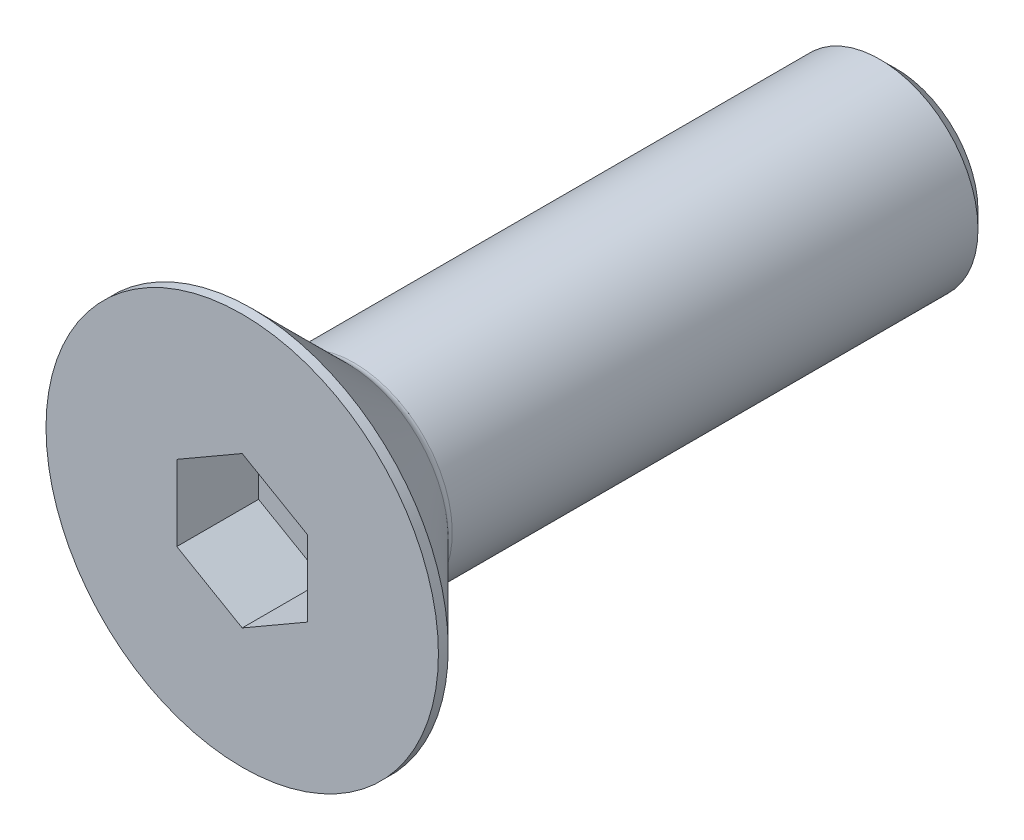
ISO-10303-21;
HEADER;
FILE_DESCRIPTION(('STEP AP214'),'2;1');
FILE_NAME('part.step','',(''),(''),'','','');
FILE_SCHEMA(('AUTOMOTIVE_DESIGN { 1 0 10303 214 1 1 1 1 }'));
ENDSEC;
DATA;
#1=APPLICATION_CONTEXT('core data for automotive mechanical design processes');
#2=APPLICATION_PROTOCOL_DEFINITION('international standard','automotive_design',2000,#1);
#3=PRODUCT_CONTEXT('',#1,'mechanical');
#4=PRODUCT('Part','Part','',(#3));
#5=PRODUCT_RELATED_PRODUCT_CATEGORY('part','',(#4));
#6=PRODUCT_DEFINITION_FORMATION('','',#4);
#7=PRODUCT_DEFINITION_CONTEXT('part definition',#1,'design');
#8=PRODUCT_DEFINITION('design','',#6,#7);
#9=PRODUCT_DEFINITION_SHAPE('','',#8);
#10=(LENGTH_UNIT() NAMED_UNIT(*) SI_UNIT(.MILLI.,.METRE.));
#11=(NAMED_UNIT(*) PLANE_ANGLE_UNIT() SI_UNIT($,.RADIAN.));
#12=(NAMED_UNIT(*) SI_UNIT($,.STERADIAN.) SOLID_ANGLE_UNIT());
#13=UNCERTAINTY_MEASURE_WITH_UNIT(LENGTH_MEASURE(1.E-05),#10,'distance_accuracy_value','');
#14=(GEOMETRIC_REPRESENTATION_CONTEXT(3) GLOBAL_UNCERTAINTY_ASSIGNED_CONTEXT((#13)) GLOBAL_UNIT_ASSIGNED_CONTEXT((#10,
#11,#12)) REPRESENTATION_CONTEXT('',''));
#15=CARTESIAN_POINT('',(0.,0.,0.));
#16=DIRECTION('',(0.,0.,1.));
#17=DIRECTION('',(1.,0.,0.));
#18=AXIS2_PLACEMENT_3D('',#15,#16,#17);
#19=CARTESIAN_POINT('',(0.,0.,-2.5));
#20=DIRECTION('',(0.,0.,1.));
#21=DIRECTION('',(1.,0.,0.));
#22=AXIS2_PLACEMENT_3D('',#19,#20,#21);
#23=PLANE('',#22);
#24=DIRECTION('',(-0.866025403784439,-0.5,0.));
#25=VECTOR('',#24,1.);
#26=CARTESIAN_POINT('',(0.,2.3094010767585,-2.5));
#27=LINE('',#26,#25);
#28=CARTESIAN_POINT('',(0.,2.3094010767585,-2.5));
#29=VERTEX_POINT('',#28);
#30=CARTESIAN_POINT('',(-2.,1.15470053837925,-2.5));
#31=VERTEX_POINT('',#30);
#32=EDGE_CURVE('E81',#29,#31,#27,.T.);
#33=ORIENTED_EDGE('',*,*,#32,.T.);
#34=DIRECTION('',(0.,1.,0.));
#35=VECTOR('',#34,1.);
#36=CARTESIAN_POINT('',(-2.,1.15470053837925,-2.5));
#37=LINE('',#36,#35);
#38=CARTESIAN_POINT('',(-2.,-1.15470053837925,-2.5));
#39=VERTEX_POINT('',#38);
#40=EDGE_CURVE('E65',#31,#39,#37,.F.);
#41=ORIENTED_EDGE('',*,*,#40,.T.);
#42=DIRECTION('',(0.866025403784439,-0.499999999999999,0.));
#43=VECTOR('',#42,1.);
#44=CARTESIAN_POINT('',(-2.,-1.15470053837925,-2.5));
#45=LINE('',#44,#43);
#46=CARTESIAN_POINT('',(0.,-2.3094010767585,-2.5));
#47=VERTEX_POINT('',#46);
#48=EDGE_CURVE('E70',#39,#47,#45,.T.);
#49=ORIENTED_EDGE('',*,*,#48,.T.);
#50=DIRECTION('',(0.866025403784439,0.5,0.));
#51=VECTOR('',#50,1.);
#52=CARTESIAN_POINT('',(0.,-2.3094010767585,-2.5));
#53=LINE('',#52,#51);
#54=CARTESIAN_POINT('',(2.,-1.15470053837925,-2.5));
#55=VERTEX_POINT('',#54);
#56=EDGE_CURVE('E127',#47,#55,#53,.T.);
#57=ORIENTED_EDGE('',*,*,#56,.T.);
#58=DIRECTION('',(0.,1.,0.));
#59=VECTOR('',#58,1.);
#60=CARTESIAN_POINT('',(2.,-1.15470053837925,-2.5));
#61=LINE('',#60,#59);
#62=CARTESIAN_POINT('',(2.,1.15470053837925,-2.5));
#63=VERTEX_POINT('',#62);
#64=EDGE_CURVE('E131',#55,#63,#61,.T.);
#65=ORIENTED_EDGE('',*,*,#64,.T.);
#66=DIRECTION('',(-0.866025403784439,0.499999999999999,0.));
#67=VECTOR('',#66,1.);
#68=CARTESIAN_POINT('',(2.,1.15470053837925,-2.5));
#69=LINE('',#68,#67);
#70=EDGE_CURVE('E136',#63,#29,#69,.T.);
#71=ORIENTED_EDGE('',*,*,#70,.T.);
#72=EDGE_LOOP('',(#33,#41,#49,#57,#65,#71));
#73=FACE_BOUND('',#72,.T.);
#74=ADVANCED_FACE('F14',(#73),#23,.T.);
#75=CARTESIAN_POINT('',(-2.,-1.15470053837925,0.));
#76=DIRECTION('',(-0.499999999999999,-0.866025403784439,0.));
#77=DIRECTION('',(0.866025403784439,-0.499999999999999,0.));
#78=AXIS2_PLACEMENT_3D('',#75,#76,#77);
#79=PLANE('',#78);
#80=DIRECTION('',(0.,0.,1.));
#81=VECTOR('',#80,1.);
#82=CARTESIAN_POINT('',(-2.,-1.15470053837925,0.));
#83=LINE('',#82,#81);
#84=CARTESIAN_POINT('',(-2.,-1.15470053837925,0.));
#85=VERTEX_POINT('',#84);
#86=EDGE_CURVE('E72',#39,#85,#83,.T.);
#87=ORIENTED_EDGE('',*,*,#86,.T.);
#88=DIRECTION('',(-0.866025403784439,0.499999999999999,0.));
#89=VECTOR('',#88,1.);
#90=CARTESIAN_POINT('',(0.,-2.3094010767585,0.));
#91=LINE('',#90,#89);
#92=CARTESIAN_POINT('',(0.,-2.3094010767585,0.));
#93=VERTEX_POINT('',#92);
#94=EDGE_CURVE('E125',#93,#85,#91,.T.);
#95=ORIENTED_EDGE('',*,*,#94,.F.);
#96=DIRECTION('',(0.,0.,1.));
#97=VECTOR('',#96,1.);
#98=CARTESIAN_POINT('',(0.,-2.3094010767585,0.));
#99=LINE('',#98,#97);
#100=EDGE_CURVE('E75',#93,#47,#99,.F.);
#101=ORIENTED_EDGE('',*,*,#100,.T.);
#102=ORIENTED_EDGE('',*,*,#48,.F.);
#103=EDGE_LOOP('',(#87,#95,#101,#102));
#104=FACE_BOUND('',#103,.T.);
#105=ADVANCED_FACE('F71',(#104),#79,.F.);
#106=CARTESIAN_POINT('',(-2.,1.15470053837925,0.));
#107=DIRECTION('',(-1.,0.,0.));
#108=DIRECTION('',(0.,0.,1.));
#109=AXIS2_PLACEMENT_3D('',#106,#107,#108);
#110=PLANE('',#109);
#111=DIRECTION('',(0.,0.,1.));
#112=VECTOR('',#111,1.);
#113=CARTESIAN_POINT('',(-2.,1.15470053837925,0.));
#114=LINE('',#113,#112);
#115=CARTESIAN_POINT('',(-2.,1.15470053837925,0.));
#116=VERTEX_POINT('',#115);
#117=EDGE_CURVE('E83',#31,#116,#114,.T.);
#118=ORIENTED_EDGE('',*,*,#117,.T.);
#119=DIRECTION('',(0.,1.,0.));
#120=VECTOR('',#119,1.);
#121=CARTESIAN_POINT('',(-2.,0.,0.));
#122=LINE('',#121,#120);
#123=EDGE_CURVE('E87',#85,#116,#122,.T.);
#124=ORIENTED_EDGE('',*,*,#123,.F.);
#125=ORIENTED_EDGE('',*,*,#86,.F.);
#126=ORIENTED_EDGE('',*,*,#40,.F.);
#127=EDGE_LOOP('',(#118,#124,#125,#126));
#128=FACE_BOUND('',#127,.T.);
#129=ADVANCED_FACE('F85',(#128),#110,.F.);
#130=CARTESIAN_POINT('',(0.,2.3094010767585,0.));
#131=DIRECTION('',(-0.5,0.866025403784439,0.));
#132=DIRECTION('',(-0.866025403784439,-0.5,0.));
#133=AXIS2_PLACEMENT_3D('',#130,#131,#132);
#134=PLANE('',#133);
#135=DIRECTION('',(0.,0.,1.));
#136=VECTOR('',#135,1.);
#137=CARTESIAN_POINT('',(0.,2.3094010767585,0.));
#138=LINE('',#137,#136);
#139=CARTESIAN_POINT('',(0.,2.3094010767585,0.));
#140=VERTEX_POINT('',#139);
#141=EDGE_CURVE('E138',#29,#140,#138,.T.);
#142=ORIENTED_EDGE('',*,*,#141,.T.);
#143=DIRECTION('',(0.866025403784439,0.5,0.));
#144=VECTOR('',#143,1.);
#145=CARTESIAN_POINT('',(-2.,1.15470053837925,0.));
#146=LINE('',#145,#144);
#147=EDGE_CURVE('E121',#116,#140,#146,.T.);
#148=ORIENTED_EDGE('',*,*,#147,.F.);
#149=ORIENTED_EDGE('',*,*,#117,.F.);
#150=ORIENTED_EDGE('',*,*,#32,.F.);
#151=EDGE_LOOP('',(#142,#148,#149,#150));
#152=FACE_BOUND('',#151,.T.);
#153=ADVANCED_FACE('F142',(#152),#134,.F.);
#154=CARTESIAN_POINT('',(2.,1.15470053837925,0.));
#155=DIRECTION('',(0.499999999999999,0.866025403784439,0.));
#156=DIRECTION('',(-0.866025403784439,0.499999999999999,0.));
#157=AXIS2_PLACEMENT_3D('',#154,#155,#156);
#158=PLANE('',#157);
#159=DIRECTION('',(0.,0.,-1.));
#160=VECTOR('',#159,1.);
#161=CARTESIAN_POINT('',(2.,1.15470053837925,0.));
#162=LINE('',#161,#160);
#163=CARTESIAN_POINT('',(2.,1.15470053837925,0.));
#164=VERTEX_POINT('',#163);
#165=EDGE_CURVE('E134',#63,#164,#162,.F.);
#166=ORIENTED_EDGE('',*,*,#165,.T.);
#167=DIRECTION('',(0.866025403784439,-0.499999999999999,0.));
#168=VECTOR('',#167,1.);
#169=CARTESIAN_POINT('',(0.,2.3094010767585,0.));
#170=LINE('',#169,#168);
#171=EDGE_CURVE('E118',#140,#164,#170,.T.);
#172=ORIENTED_EDGE('',*,*,#171,.F.);
#173=ORIENTED_EDGE('',*,*,#141,.F.);
#174=ORIENTED_EDGE('',*,*,#70,.F.);
#175=EDGE_LOOP('',(#166,#172,#173,#174));
#176=FACE_BOUND('',#175,.T.);
#177=ADVANCED_FACE('F153',(#176),#158,.F.);
#178=CARTESIAN_POINT('',(2.,-1.15470053837925,0.));
#179=DIRECTION('',(1.,0.,0.));
#180=DIRECTION('',(0.,0.,-1.));
#181=AXIS2_PLACEMENT_3D('',#178,#179,#180);
#182=PLANE('',#181);
#183=DIRECTION('',(0.,0.,1.));
#184=VECTOR('',#183,1.);
#185=CARTESIAN_POINT('',(2.,-1.15470053837925,0.));
#186=LINE('',#185,#184);
#187=CARTESIAN_POINT('',(2.,-1.15470053837925,0.));
#188=VERTEX_POINT('',#187);
#189=EDGE_CURVE('E33',#55,#188,#186,.T.);
#190=ORIENTED_EDGE('',*,*,#189,.T.);
#191=DIRECTION('',(0.,1.,0.));
#192=VECTOR('',#191,1.);
#193=CARTESIAN_POINT('',(2.,0.,0.));
#194=LINE('',#193,#192);
#195=EDGE_CURVE('E115',#164,#188,#194,.F.);
#196=ORIENTED_EDGE('',*,*,#195,.F.);
#197=ORIENTED_EDGE('',*,*,#165,.F.);
#198=ORIENTED_EDGE('',*,*,#64,.F.);
#199=EDGE_LOOP('',(#190,#196,#197,#198));
#200=FACE_BOUND('',#199,.T.);
#201=ADVANCED_FACE('F151',(#200),#182,.F.);
#202=CARTESIAN_POINT('',(0.,-2.3094010767585,0.));
#203=DIRECTION('',(0.5,-0.866025403784439,0.));
#204=DIRECTION('',(0.866025403784439,0.5,0.));
#205=AXIS2_PLACEMENT_3D('',#202,#203,#204);
#206=PLANE('',#205);
#207=ORIENTED_EDGE('',*,*,#100,.F.);
#208=DIRECTION('',(-0.866025403784439,-0.5,0.));
#209=VECTOR('',#208,1.);
#210=CARTESIAN_POINT('',(2.,-1.15470053837925,0.));
#211=LINE('',#210,#209);
#212=EDGE_CURVE('E112',#188,#93,#211,.T.);
#213=ORIENTED_EDGE('',*,*,#212,.F.);
#214=ORIENTED_EDGE('',*,*,#189,.F.);
#215=ORIENTED_EDGE('',*,*,#56,.F.);
#216=EDGE_LOOP('',(#207,#213,#214,#215));
#217=FACE_BOUND('',#216,.T.);
#218=ADVANCED_FACE('F149',(#217),#206,.F.);
#219=CARTESIAN_POINT('',(3.,0.,0.));
#220=DIRECTION('',(0.,0.,1.));
#221=DIRECTION('',(1.,0.,0.));
#222=AXIS2_PLACEMENT_3D('',#219,#220,#221);
#223=PLANE('',#222);
#224=ORIENTED_EDGE('',*,*,#195,.T.);
#225=ORIENTED_EDGE('',*,*,#212,.T.);
#226=ORIENTED_EDGE('',*,*,#94,.T.);
#227=ORIENTED_EDGE('',*,*,#123,.T.);
#228=ORIENTED_EDGE('',*,*,#147,.T.);
#229=ORIENTED_EDGE('',*,*,#171,.T.);
#230=EDGE_LOOP('',(#224,#225,#226,#227,#228,#229));
#231=FACE_BOUND('',#230,.T.);
#232=CARTESIAN_POINT('',(0.,0.,0.));
#233=DIRECTION('',(0.,0.,-1.));
#234=DIRECTION('',(-1.,0.,0.));
#235=AXIS2_PLACEMENT_3D('',#232,#233,#234);
#236=CIRCLE('',#235,6.);
#237=CARTESIAN_POINT('',(-6.,0.,0.));
#238=VERTEX_POINT('',#237);
#239=EDGE_CURVE('E18',#238,#238,#236,.T.);
#240=ORIENTED_EDGE('',*,*,#239,.F.);
#241=EDGE_LOOP('',(#240));
#242=FACE_BOUND('',#241,.T.);
#243=ADVANCED_FACE('F146',(#231,#242),#223,.T.);
#244=CARTESIAN_POINT('',(0.,0.,-0.150000000000001));
#245=DIRECTION('',(0.,0.,-1.));
#246=DIRECTION('',(-1.,0.,0.));
#247=AXIS2_PLACEMENT_3D('',#244,#245,#246);
#248=CYLINDRICAL_SURFACE('',#247,6.);
#249=ORIENTED_EDGE('',*,*,#239,.T.);
#250=EDGE_LOOP('',(#249));
#251=FACE_BOUND('',#250,.T.);
#252=CARTESIAN_POINT('',(0.,0.,-0.299999998617295));
#253=DIRECTION('',(0.,0.,1.));
#254=DIRECTION('',(1.,0.,0.));
#255=AXIS2_PLACEMENT_3D('',#252,#253,#254);
#256=CIRCLE('',#255,5.99999999872125);
#257=CARTESIAN_POINT('',(5.99999999872125,0.,-0.299999998617295));
#258=VERTEX_POINT('',#257);
#259=EDGE_CURVE('E99',#258,#258,#256,.F.);
#260=ORIENTED_EDGE('',*,*,#259,.F.);
#261=EDGE_LOOP('',(#260));
#262=FACE_BOUND('',#261,.T.);
#263=ADVANCED_FACE('F182',(#251,#262),#248,.T.);
#264=CARTESIAN_POINT('',(0.,0.,-0.299999998617295));
#265=DIRECTION('',(0.,0.,1.));
#266=DIRECTION('',(1.,0.,0.));
#267=AXIS2_PLACEMENT_3D('',#264,#265,#266);
#268=CONICAL_SURFACE('',#267,5.99999999872125,0.78539816249955);
#269=CARTESIAN_POINT('',(0.,0.,-3.21213203435597));
#270=DIRECTION('',(0.,0.,-1.));
#271=DIRECTION('',(0.,1.,0.));
#272=AXIS2_PLACEMENT_3D('',#269,#270,#271);
#273=CIRCLE('',#272,3.08786796564404);
#274=CARTESIAN_POINT('',(0.,3.08786796564404,-3.21213203435597));
#275=VERTEX_POINT('',#274);
#276=EDGE_CURVE('E93',#275,#275,#273,.T.);
#277=ORIENTED_EDGE('',*,*,#276,.F.);
#278=EDGE_LOOP('',(#277));
#279=FACE_BOUND('',#278,.T.);
#280=ORIENTED_EDGE('',*,*,#259,.T.);
#281=EDGE_LOOP('',(#280));
#282=FACE_BOUND('',#281,.T.);
#283=ADVANCED_FACE('F178',(#279,#282),#268,.T.);
#284=CARTESIAN_POINT('',(1.5,0.,-20.));
#285=DIRECTION('',(0.,0.,-1.));
#286=DIRECTION('',(-1.,0.,0.));
#287=AXIS2_PLACEMENT_3D('',#284,#285,#286);
#288=PLANE('',#287);
#289=CARTESIAN_POINT('',(0.,0.,-20.0000000002092));
#290=DIRECTION('',(0.,0.,1.));
#291=DIRECTION('',(1.,0.,0.));
#292=AXIS2_PLACEMENT_3D('',#289,#290,#291);
#293=CIRCLE('',#292,2.5000000002251);
#294=CARTESIAN_POINT('',(2.5000000002251,0.,-20.0000000002092));
#295=VERTEX_POINT('',#294);
#296=EDGE_CURVE('E91',#295,#295,#293,.T.);
#297=ORIENTED_EDGE('',*,*,#296,.F.);
#298=EDGE_LOOP('',(#297));
#299=FACE_BOUND('',#298,.T.);
#300=ADVANCED_FACE('F175',(#299),#288,.T.);
#301=CARTESIAN_POINT('',(0.,0.,-3.42426406871193));
#302=DIRECTION('',(0.,0.,-1.));
#303=DIRECTION('',(0.,1.,0.));
#304=AXIS2_PLACEMENT_3D('',#301,#302,#303);
#305=TOROIDAL_SURFACE('',#304,3.3,0.3);
#306=CARTESIAN_POINT('',(0.,0.,-3.42426406871193));
#307=DIRECTION('',(0.,0.,-1.));
#308=DIRECTION('',(-1.,0.,0.));
#309=AXIS2_PLACEMENT_3D('',#306,#307,#308);
#310=CIRCLE('',#309,3.);
#311=CARTESIAN_POINT('',(-3.,0.,-3.42426406871193));
#312=VERTEX_POINT('',#311);
#313=EDGE_CURVE('E24',#312,#312,#310,.T.);
#314=ORIENTED_EDGE('',*,*,#313,.F.);
#315=EDGE_LOOP('',(#314));
#316=FACE_BOUND('',#315,.T.);
#317=ORIENTED_EDGE('',*,*,#276,.T.);
#318=EDGE_LOOP('',(#317));
#319=FACE_BOUND('',#318,.T.);
#320=ADVANCED_FACE('F16',(#316,#319),#305,.F.);
#321=CARTESIAN_POINT('',(0.,0.,-19.4999999997663));
#322=DIRECTION('',(0.,0.,1.));
#323=DIRECTION('',(1.,0.,0.));
#324=AXIS2_PLACEMENT_3D('',#321,#322,#323);
#325=CONICAL_SURFACE('',#324,2.99999999975853,0.785398162487954);
#326=ORIENTED_EDGE('',*,*,#296,.T.);
#327=EDGE_LOOP('',(#326));
#328=FACE_BOUND('',#327,.T.);
#329=CARTESIAN_POINT('',(0.,0.,-19.5));
#330=DIRECTION('',(0.,0.,-1.));
#331=DIRECTION('',(-1.,0.,0.));
#332=AXIS2_PLACEMENT_3D('',#329,#330,#331);
#333=CIRCLE('',#332,3.);
#334=CARTESIAN_POINT('',(-3.,0.,-19.5));
#335=VERTEX_POINT('',#334);
#336=EDGE_CURVE('E9',#335,#335,#333,.F.);
#337=ORIENTED_EDGE('',*,*,#336,.F.);
#338=EDGE_LOOP('',(#337));
#339=FACE_BOUND('',#338,.T.);
#340=ADVANCED_FACE('F165',(#328,#339),#325,.T.);
#341=CARTESIAN_POINT('',(0.,0.,-11.65));
#342=DIRECTION('',(0.,0.,-1.));
#343=DIRECTION('',(-1.,0.,0.));
#344=AXIS2_PLACEMENT_3D('',#341,#342,#343);
#345=CYLINDRICAL_SURFACE('',#344,3.);
#346=ORIENTED_EDGE('',*,*,#336,.T.);
#347=EDGE_LOOP('',(#346));
#348=FACE_BOUND('',#347,.T.);
#349=ORIENTED_EDGE('',*,*,#313,.T.);
#350=EDGE_LOOP('',(#349));
#351=FACE_BOUND('',#350,.T.);
#352=ADVANCED_FACE('F163',(#348,#351),#345,.T.);
#353=CLOSED_SHELL('',(#74,#105,#129,#153,#177,#201,#218,#243,#263,#283,#300,#320,#340,#352));
#354=MANIFOLD_SOLID_BREP('B1',#353);
#355=ADVANCED_BREP_SHAPE_REPRESENTATION('',(#18,#354),#14);
#356=SHAPE_DEFINITION_REPRESENTATION(#9,#355);
ENDSEC;
END-ISO-10303-21;
